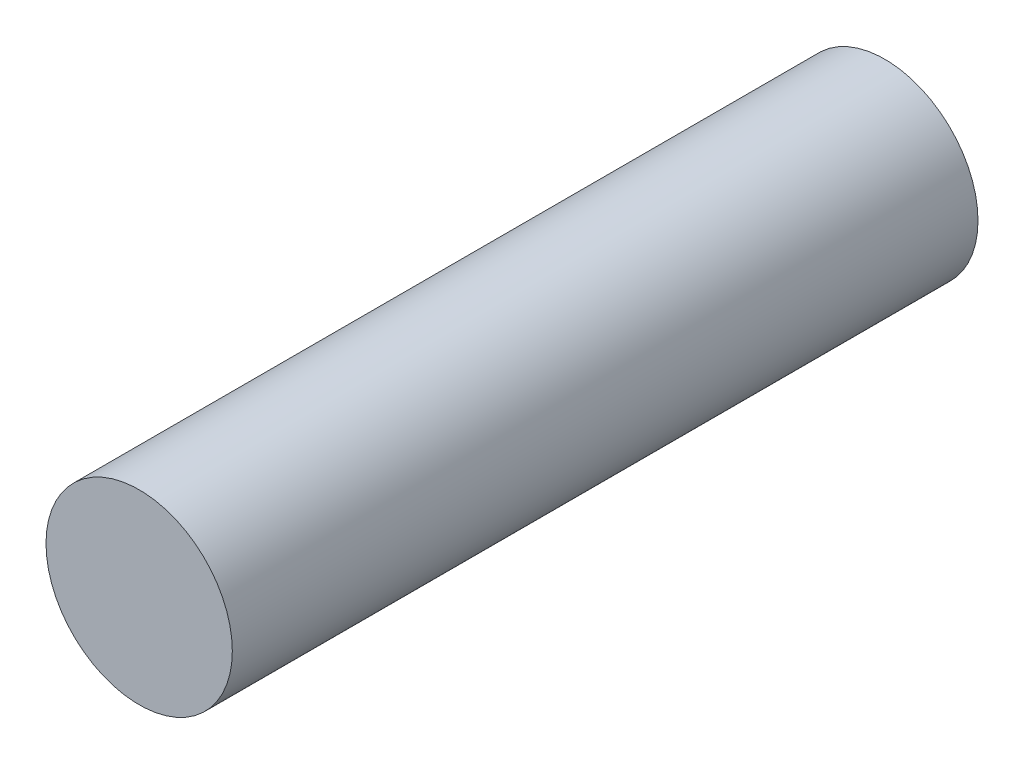
ISO-10303-21;
HEADER;
FILE_DESCRIPTION(('STEP AP214'),'2;1');
FILE_NAME('part.step','',(''),(''),'','','');
FILE_SCHEMA(('AUTOMOTIVE_DESIGN { 1 0 10303 214 1 1 1 1 }'));
ENDSEC;
DATA;
#1=APPLICATION_CONTEXT('core data for automotive mechanical design processes');
#2=APPLICATION_PROTOCOL_DEFINITION('international standard','automotive_design',2000,#1);
#3=PRODUCT_CONTEXT('',#1,'mechanical');
#4=PRODUCT('Part','Part','',(#3));
#5=PRODUCT_RELATED_PRODUCT_CATEGORY('part','',(#4));
#6=PRODUCT_DEFINITION_FORMATION('','',#4);
#7=PRODUCT_DEFINITION_CONTEXT('part definition',#1,'design');
#8=PRODUCT_DEFINITION('design','',#6,#7);
#9=PRODUCT_DEFINITION_SHAPE('','',#8);
#10=(LENGTH_UNIT() NAMED_UNIT(*) SI_UNIT(.MILLI.,.METRE.));
#11=(NAMED_UNIT(*) PLANE_ANGLE_UNIT() SI_UNIT($,.RADIAN.));
#12=(NAMED_UNIT(*) SI_UNIT($,.STERADIAN.) SOLID_ANGLE_UNIT());
#13=UNCERTAINTY_MEASURE_WITH_UNIT(LENGTH_MEASURE(1.E-05),#10,'distance_accuracy_value','');
#14=(GEOMETRIC_REPRESENTATION_CONTEXT(3) GLOBAL_UNCERTAINTY_ASSIGNED_CONTEXT((#13)) GLOBAL_UNIT_ASSIGNED_CONTEXT((#10,
#11,#12)) REPRESENTATION_CONTEXT('',''));
#15=CARTESIAN_POINT('',(0.,0.,0.));
#16=DIRECTION('',(0.,0.,1.));
#17=DIRECTION('',(1.,0.,0.));
#18=AXIS2_PLACEMENT_3D('',#15,#16,#17);
#19=CARTESIAN_POINT('',(0.,0.,38.1));
#20=DIRECTION('',(0.,0.,-1.));
#21=DIRECTION('',(-1.,0.,0.));
#22=AXIS2_PLACEMENT_3D('',#19,#20,#21);
#23=CYLINDRICAL_SURFACE('',#22,4.76);
#24=CARTESIAN_POINT('',(0.,0.,38.1));
#25=DIRECTION('',(0.,0.,1.));
#26=DIRECTION('',(1.,0.,0.));
#27=AXIS2_PLACEMENT_3D('',#24,#25,#26);
#28=CIRCLE('',#27,4.76);
#29=CARTESIAN_POINT('',(4.76,0.,38.1));
#30=VERTEX_POINT('',#29);
#31=EDGE_CURVE('E10',#30,#30,#28,.T.);
#32=ORIENTED_EDGE('',*,*,#31,.F.);
#33=EDGE_LOOP('',(#32));
#34=FACE_BOUND('',#33,.T.);
#35=CARTESIAN_POINT('',(0.,0.,0.));
#36=DIRECTION('',(0.,0.,1.));
#37=DIRECTION('',(1.,0.,0.));
#38=AXIS2_PLACEMENT_3D('',#35,#36,#37);
#39=CIRCLE('',#38,4.76);
#40=CARTESIAN_POINT('',(4.76,0.,0.));
#41=VERTEX_POINT('',#40);
#42=EDGE_CURVE('E42',#41,#41,#39,.T.);
#43=ORIENTED_EDGE('',*,*,#42,.T.);
#44=EDGE_LOOP('',(#43));
#45=FACE_BOUND('',#44,.T.);
#46=ADVANCED_FACE('F39',(#34,#45),#23,.T.);
#47=CARTESIAN_POINT('',(0.,0.,38.1));
#48=DIRECTION('',(0.,0.,1.));
#49=DIRECTION('',(1.,0.,0.));
#50=AXIS2_PLACEMENT_3D('',#47,#48,#49);
#51=PLANE('',#50);
#52=ORIENTED_EDGE('',*,*,#31,.T.);
#53=EDGE_LOOP('',(#52));
#54=FACE_BOUND('',#53,.T.);
#55=ADVANCED_FACE('F56',(#54),#51,.T.);
#56=CARTESIAN_POINT('',(0.,0.,0.));
#57=DIRECTION('',(0.,0.,1.));
#58=DIRECTION('',(1.,0.,0.));
#59=AXIS2_PLACEMENT_3D('',#56,#57,#58);
#60=PLANE('',#59);
#61=ORIENTED_EDGE('',*,*,#42,.F.);
#62=EDGE_LOOP('',(#61));
#63=FACE_BOUND('',#62,.T.);
#64=ADVANCED_FACE('F54',(#63),#60,.F.);
#65=CLOSED_SHELL('',(#46,#55,#64));
#66=MANIFOLD_SOLID_BREP('B2',#65);
#67=ADVANCED_BREP_SHAPE_REPRESENTATION('',(#18,#66),#14);
#68=SHAPE_DEFINITION_REPRESENTATION(#9,#67);
ENDSEC;
END-ISO-10303-21;
